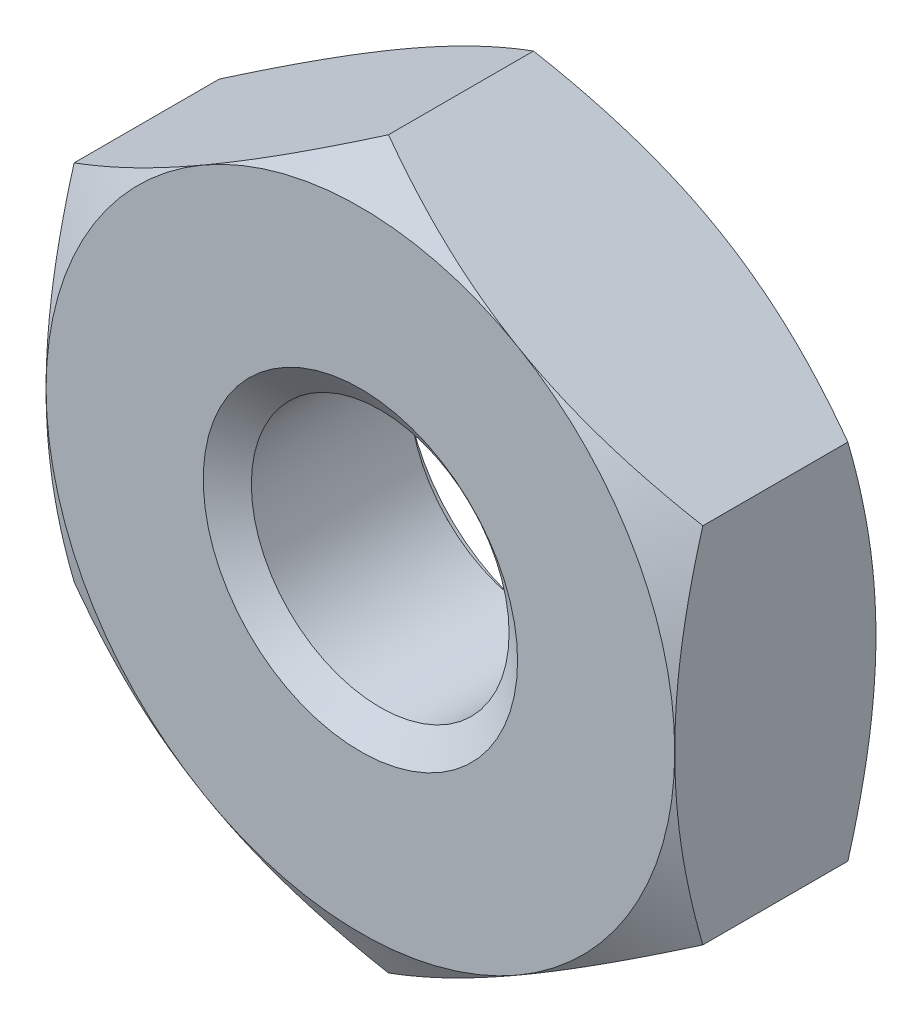
ISO-10303-21;
HEADER;
FILE_DESCRIPTION(('STEP AP214'),'2;1');
FILE_NAME('part.step','',(''),(''),'','','');
FILE_SCHEMA(('AUTOMOTIVE_DESIGN { 1 0 10303 214 1 1 1 1 }'));
ENDSEC;
DATA;
#1=APPLICATION_CONTEXT('core data for automotive mechanical design processes');
#2=APPLICATION_PROTOCOL_DEFINITION('international standard','automotive_design',2000,#1);
#3=PRODUCT_CONTEXT('',#1,'mechanical');
#4=PRODUCT('Part','Part','',(#3));
#5=PRODUCT_RELATED_PRODUCT_CATEGORY('part','',(#4));
#6=PRODUCT_DEFINITION_FORMATION('','',#4);
#7=PRODUCT_DEFINITION_CONTEXT('part definition',#1,'design');
#8=PRODUCT_DEFINITION('design','',#6,#7);
#9=PRODUCT_DEFINITION_SHAPE('','',#8);
#10=(LENGTH_UNIT() NAMED_UNIT(*) SI_UNIT(.MILLI.,.METRE.));
#11=(NAMED_UNIT(*) PLANE_ANGLE_UNIT() SI_UNIT($,.RADIAN.));
#12=(NAMED_UNIT(*) SI_UNIT($,.STERADIAN.) SOLID_ANGLE_UNIT());
#13=UNCERTAINTY_MEASURE_WITH_UNIT(LENGTH_MEASURE(1.E-05),#10,'distance_accuracy_value','');
#14=(GEOMETRIC_REPRESENTATION_CONTEXT(3) GLOBAL_UNCERTAINTY_ASSIGNED_CONTEXT((#13)) GLOBAL_UNIT_ASSIGNED_CONTEXT((#10,
#11,#12)) REPRESENTATION_CONTEXT('',''));
#15=CARTESIAN_POINT('',(0.,0.,0.));
#16=DIRECTION('',(0.,0.,1.));
#17=DIRECTION('',(1.,0.,0.));
#18=AXIS2_PLACEMENT_3D('',#15,#16,#17);
#19=CARTESIAN_POINT('',(0.,0.,-1.6));
#20=DIRECTION('',(0.,0.,1.));
#21=DIRECTION('',(1.,0.,0.));
#22=AXIS2_PLACEMENT_3D('',#19,#20,#21);
#23=CYLINDRICAL_SURFACE('',#22,1.025);
#24=CARTESIAN_POINT('',(0.,0.,-0.157546696097185));
#25=DIRECTION('',(0.,0.,1.));
#26=DIRECTION('',(1.,0.,0.));
#27=AXIS2_PLACEMENT_3D('',#24,#25,#26);
#28=CIRCLE('',#27,1.025);
#29=CARTESIAN_POINT('',(1.025,0.,-0.157546696097185));
#30=VERTEX_POINT('',#29);
#31=EDGE_CURVE('E176',#30,#30,#28,.F.);
#32=ORIENTED_EDGE('',*,*,#31,.F.);
#33=EDGE_LOOP('',(#32));
#34=FACE_BOUND('',#33,.T.);
#35=CARTESIAN_POINT('',(0.,0.,-1.41705330390281));
#36=DIRECTION('',(0.,0.,-1.));
#37=DIRECTION('',(-1.,0.,0.));
#38=AXIS2_PLACEMENT_3D('',#35,#36,#37);
#39=CIRCLE('',#38,1.025);
#40=CARTESIAN_POINT('',(-1.025,0.,-1.41705330390281));
#41=VERTEX_POINT('',#40);
#42=EDGE_CURVE('E41',#41,#41,#39,.F.);
#43=ORIENTED_EDGE('',*,*,#42,.F.);
#44=EDGE_LOOP('',(#43));
#45=FACE_BOUND('',#44,.T.);
#46=ADVANCED_FACE('F36',(#34,#45),#23,.F.);
#47=CARTESIAN_POINT('',(0.,2.88675134594813,-1.6));
#48=DIRECTION('',(0.,0.,-1.));
#49=DIRECTION('',(-1.,0.,0.));
#50=AXIS2_PLACEMENT_3D('',#47,#48,#49);
#51=PLANE('',#50);
#52=CARTESIAN_POINT('',(0.,0.,-1.6));
#53=DIRECTION('',(0.,0.,-1.));
#54=DIRECTION('',(-1.,0.,0.));
#55=AXIS2_PLACEMENT_3D('',#52,#53,#54);
#56=CIRCLE('',#55,2.5);
#57=CARTESIAN_POINT('',(-2.5,0.,-1.6));
#58=VERTEX_POINT('',#57);
#59=CARTESIAN_POINT('',(-1.25,-2.1650635094611,-1.6));
#60=VERTEX_POINT('',#59);
#61=EDGE_CURVE('E172',#58,#60,#56,.F.);
#62=ORIENTED_EDGE('',*,*,#61,.F.);
#63=CARTESIAN_POINT('',(-1.25,2.1650635094611,-1.6));
#64=VERTEX_POINT('',#63);
#65=EDGE_CURVE('E154',#64,#58,#56,.F.);
#66=ORIENTED_EDGE('',*,*,#65,.F.);
#67=CARTESIAN_POINT('',(1.25,2.1650635094611,-1.6));
#68=VERTEX_POINT('',#67);
#69=EDGE_CURVE('E171',#68,#64,#56,.F.);
#70=ORIENTED_EDGE('',*,*,#69,.F.);
#71=CARTESIAN_POINT('',(0.,0.,-1.6));
#72=DIRECTION('',(0.,0.,1.));
#73=DIRECTION('',(1.,0.,0.));
#74=AXIS2_PLACEMENT_3D('',#71,#72,#73);
#75=CIRCLE('',#74,2.5);
#76=CARTESIAN_POINT('',(2.5,0.,-1.6));
#77=VERTEX_POINT('',#76);
#78=EDGE_CURVE('E246',#77,#68,#75,.T.);
#79=ORIENTED_EDGE('',*,*,#78,.F.);
#80=CARTESIAN_POINT('',(1.25,-2.1650635094611,-1.6));
#81=VERTEX_POINT('',#80);
#82=EDGE_CURVE('E362',#81,#77,#56,.F.);
#83=ORIENTED_EDGE('',*,*,#82,.F.);
#84=EDGE_CURVE('E366',#60,#81,#56,.F.);
#85=ORIENTED_EDGE('',*,*,#84,.F.);
#86=EDGE_LOOP('',(#62,#66,#70,#79,#83,#85));
#87=FACE_BOUND('',#86,.T.);
#88=CARTESIAN_POINT('',(0.,0.,-1.6));
#89=DIRECTION('',(0.,0.,-1.));
#90=DIRECTION('',(-1.,0.,0.));
#91=AXIS2_PLACEMENT_3D('',#88,#89,#90);
#92=CIRCLE('',#91,1.25);
#93=CARTESIAN_POINT('',(-1.25,0.,-1.6));
#94=VERTEX_POINT('',#93);
#95=EDGE_CURVE('E179',#94,#94,#92,.F.);
#96=ORIENTED_EDGE('',*,*,#95,.T.);
#97=EDGE_LOOP('',(#96));
#98=FACE_BOUND('',#97,.T.);
#99=ADVANCED_FACE('F299',(#87,#98),#51,.T.);
#100=CARTESIAN_POINT('',(0.,2.88675134594813,0.));
#101=DIRECTION('',(0.,0.,-1.));
#102=DIRECTION('',(-1.,0.,0.));
#103=AXIS2_PLACEMENT_3D('',#100,#101,#102);
#104=PLANE('',#103);
#105=CARTESIAN_POINT('',(0.,0.,0.));
#106=DIRECTION('',(0.,0.,-1.));
#107=DIRECTION('',(-1.,0.,0.));
#108=AXIS2_PLACEMENT_3D('',#105,#106,#107);
#109=CIRCLE('',#108,2.5);
#110=CARTESIAN_POINT('',(-2.5,0.,0.));
#111=VERTEX_POINT('',#110);
#112=CARTESIAN_POINT('',(-1.25,2.1650635094611,0.));
#113=VERTEX_POINT('',#112);
#114=EDGE_CURVE('E11',#111,#113,#109,.T.);
#115=ORIENTED_EDGE('',*,*,#114,.F.);
#116=CARTESIAN_POINT('',(-1.25,-2.1650635094611,0.));
#117=VERTEX_POINT('',#116);
#118=EDGE_CURVE('E48',#117,#111,#109,.T.);
#119=ORIENTED_EDGE('',*,*,#118,.F.);
#120=CARTESIAN_POINT('',(1.25,-2.1650635094611,0.));
#121=VERTEX_POINT('',#120);
#122=EDGE_CURVE('E175',#121,#117,#109,.T.);
#123=ORIENTED_EDGE('',*,*,#122,.F.);
#124=CARTESIAN_POINT('',(2.5,0.,0.));
#125=VERTEX_POINT('',#124);
#126=EDGE_CURVE('E353',#125,#121,#109,.T.);
#127=ORIENTED_EDGE('',*,*,#126,.F.);
#128=CARTESIAN_POINT('',(0.,0.,0.));
#129=DIRECTION('',(0.,0.,1.));
#130=DIRECTION('',(1.,0.,0.));
#131=AXIS2_PLACEMENT_3D('',#128,#129,#130);
#132=CIRCLE('',#131,2.5);
#133=CARTESIAN_POINT('',(1.25,2.1650635094611,0.));
#134=VERTEX_POINT('',#133);
#135=EDGE_CURVE('E130',#125,#134,#132,.T.);
#136=ORIENTED_EDGE('',*,*,#135,.T.);
#137=EDGE_CURVE('E46',#113,#134,#109,.T.);
#138=ORIENTED_EDGE('',*,*,#137,.F.);
#139=EDGE_LOOP('',(#115,#119,#123,#127,#136,#138));
#140=FACE_BOUND('',#139,.T.);
#141=CARTESIAN_POINT('',(0.,0.,0.));
#142=DIRECTION('',(0.,0.,1.));
#143=DIRECTION('',(1.,0.,0.));
#144=AXIS2_PLACEMENT_3D('',#141,#142,#143);
#145=CIRCLE('',#144,1.25);
#146=CARTESIAN_POINT('',(1.25,0.,0.));
#147=VERTEX_POINT('',#146);
#148=EDGE_CURVE('E178',#147,#147,#145,.T.);
#149=ORIENTED_EDGE('',*,*,#148,.F.);
#150=EDGE_LOOP('',(#149));
#151=FACE_BOUND('',#150,.T.);
#152=ADVANCED_FACE('F251',(#140,#151),#104,.F.);
#153=CARTESIAN_POINT('',(0.,2.88675134594813,-1.6));
#154=DIRECTION('',(-0.500000000000001,0.866025403784438,0.));
#155=DIRECTION('',(-0.866025403784438,-0.500000000000001,0.));
#156=AXIS2_PLACEMENT_3D('',#153,#154,#155);
#157=PLANE('',#156);
#158=DIRECTION('',(0.,0.,1.));
#159=VECTOR('',#158,1.);
#160=CARTESIAN_POINT('',(-2.5,1.44337567297406,-1.6));
#161=LINE('',#160,#159);
#162=CARTESIAN_POINT('',(-2.5,1.44337567297407,-1.3767090063074));
#163=VERTEX_POINT('',#162);
#164=CARTESIAN_POINT('',(-2.5,1.44337567297406,-0.223290993692602));
#165=VERTEX_POINT('',#164);
#166=EDGE_CURVE('E166',#163,#165,#161,.T.);
#167=ORIENTED_EDGE('',*,*,#166,.T.);
#168=CARTESIAN_POINT('',(-2.5002,1.44326020292023,-0.223357664359109));
#169=CARTESIAN_POINT('',(-2.39033676526513,1.50668977106845,-0.186721620107626));
#170=CARTESIAN_POINT('',(-2.27952520010347,1.57066685804385,-0.153402218965056));
#171=CARTESIAN_POINT('',(-2.05598316653395,1.69972891130041,-0.095242285557858));
#172=CARTESIAN_POINT('',(-1.94324872547161,1.7648161711947,-0.0704223291477385));
#173=CARTESIAN_POINT('',(-1.71917700612473,1.8941840386774,-0.0317856514410522));
#174=CARTESIAN_POINT('',(-1.60787420823262,1.95844473900197,-0.0177117961856392));
#175=CARTESIAN_POINT('',(-1.38474477253167,2.08726857876804,-0.0009091523527504));
#176=CARTESIAN_POINT('',(-1.27291894598577,2.15183124982667,0.00183354879637324));
#177=CARTESIAN_POINT('',(-1.06395802444848,2.27247489412634,-0.00386576000805384));
#178=CARTESIAN_POINT('',(-0.966791682442269,2.32857390783979,-0.0109083943818622));
#179=CARTESIAN_POINT('',(-0.773092050288997,2.44040644260542,-0.0332314191249434));
#180=CARTESIAN_POINT('',(-0.676559430340267,2.4961395767184,-0.0485194384402682));
#181=CARTESIAN_POINT('',(-0.482460278259523,2.60820277442169,-0.0867390938444218));
#182=CARTESIAN_POINT('',(-0.384918318217859,2.66451865130903,-0.109832776125519));
#183=CARTESIAN_POINT('',(-0.191289391923914,2.77631036402774,-0.162246656577915));
#184=CARTESIAN_POINT('',(-0.0951999441138233,2.83178763258718,-0.191554535624551));
#185=CARTESIAN_POINT('',(0.000200000000000702,2.88686681600197,-0.223357664359111));
#186=B_SPLINE_CURVE_WITH_KNOTS('',3,(#168,#169,#170,#171,#172,#173,#174,#175,#176,#177,#178,
#179,#180,#181,#182,#183,#184,#185),.UNSPECIFIED.,.F.,.F.,(4,2,2,2,2,2,2,2,4),(0.,
0.396285827362227,0.793524330152052,1.18093086852114,1.56786160134475,1.90479741793733,
2.24204551660463,2.58677531536756,2.93082800105257),.UNSPECIFIED.);
#187=EDGE_CURVE('E135',#165,#113,#186,.T.);
#188=ORIENTED_EDGE('',*,*,#187,.T.);
#189=CARTESIAN_POINT('',(0.,2.88675134594813,-0.223290993692604));
#190=VERTEX_POINT('',#189);
#191=EDGE_CURVE('E55',#113,#190,#186,.T.);
#192=ORIENTED_EDGE('',*,*,#191,.T.);
#193=DIRECTION('',(0.,0.,1.));
#194=VECTOR('',#193,1.);
#195=CARTESIAN_POINT('',(0.,2.88675134594813,-1.6));
#196=LINE('',#195,#194);
#197=CARTESIAN_POINT('',(0.,2.88675134594813,-1.3767090063074));
#198=VERTEX_POINT('',#197);
#199=EDGE_CURVE('E151',#198,#190,#196,.T.);
#200=ORIENTED_EDGE('',*,*,#199,.F.);
#201=CARTESIAN_POINT('',(-2.5002,1.44326020292023,-1.37664233564089));
#202=CARTESIAN_POINT('',(-2.39033676526513,1.50668977106845,-1.41327837989237));
#203=CARTESIAN_POINT('',(-2.27952520010347,1.57066685804385,-1.44659778103494));
#204=CARTESIAN_POINT('',(-2.05598316653395,1.69972891130041,-1.50475771444214));
#205=CARTESIAN_POINT('',(-1.94324872547161,1.7648161711947,-1.52957767085226));
#206=CARTESIAN_POINT('',(-1.71917700612473,1.8941840386774,-1.56821434855895));
#207=CARTESIAN_POINT('',(-1.60787420823262,1.95844473900197,-1.58228820381436));
#208=CARTESIAN_POINT('',(-1.38474477253167,2.08726857876804,-1.59909084764725));
#209=CARTESIAN_POINT('',(-1.27291894598577,2.15183124982667,-1.60183354879637));
#210=CARTESIAN_POINT('',(-1.06395802444848,2.27247489412634,-1.59613423999195));
#211=CARTESIAN_POINT('',(-0.966791682442269,2.32857390783979,-1.58909160561814));
#212=CARTESIAN_POINT('',(-0.773092050288997,2.44040644260542,-1.56676858087506));
#213=CARTESIAN_POINT('',(-0.676559430340267,2.4961395767184,-1.55148056155973));
#214=CARTESIAN_POINT('',(-0.482460278259523,2.60820277442169,-1.51326090615558));
#215=CARTESIAN_POINT('',(-0.384918318217859,2.66451865130903,-1.49016722387448));
#216=CARTESIAN_POINT('',(-0.191289391923914,2.77631036402774,-1.43775334342208));
#217=CARTESIAN_POINT('',(-0.0951999441138231,2.83178763258718,-1.40844546437545));
#218=CARTESIAN_POINT('',(0.000200000000000703,2.88686681600197,-1.37664233564089));
#219=B_SPLINE_CURVE_WITH_KNOTS('',3,(#201,#202,#203,#204,#205,#206,#207,#208,#209,#210,#211,
#212,#213,#214,#215,#216,#217,#218),.UNSPECIFIED.,.F.,.F.,(4,2,2,2,2,2,2,2,4),(0.,
0.396285827362227,0.793524330152051,1.18093086852114,1.56786160134475,1.90479741793733,
2.24204551660463,2.58677531536756,2.93082800105257),.UNSPECIFIED.);
#220=EDGE_CURVE('E169',#64,#198,#219,.T.);
#221=ORIENTED_EDGE('',*,*,#220,.F.);
#222=EDGE_CURVE('E261',#163,#64,#219,.T.);
#223=ORIENTED_EDGE('',*,*,#222,.F.);
#224=EDGE_LOOP('',(#167,#188,#192,#200,#221,#223));
#225=FACE_BOUND('',#224,.T.);
#226=ADVANCED_FACE('F38',(#225),#157,.T.);
#227=CARTESIAN_POINT('',(2.5,1.44337567297406,-1.6));
#228=DIRECTION('',(0.500000000000001,0.866025403784438,0.));
#229=DIRECTION('',(-0.866025403784438,0.500000000000001,0.));
#230=AXIS2_PLACEMENT_3D('',#227,#228,#229);
#231=PLANE('',#230);
#232=ORIENTED_EDGE('',*,*,#199,.T.);
#233=CARTESIAN_POINT('',(-0.000199999999999425,2.88686681600197,-0.223357664359111));
#234=CARTESIAN_POINT('',(0.109663234734872,2.82343724785375,-0.186721620107628));
#235=CARTESIAN_POINT('',(0.220474799896526,2.75946016087834,-0.153402218965058));
#236=CARTESIAN_POINT('',(0.44401683346605,2.63039810762178,-0.095242285557859));
#237=CARTESIAN_POINT('',(0.556751274528389,2.5653108477275,-0.0704223291477394));
#238=CARTESIAN_POINT('',(0.780822993875269,2.43594298024479,-0.0317856514410528));
#239=CARTESIAN_POINT('',(0.892125791767378,2.37168227992023,-0.0177117961856394));
#240=CARTESIAN_POINT('',(1.11525522746833,2.24285844015415,-0.000909152352750264));
#241=CARTESIAN_POINT('',(1.22708105401423,2.17829576909552,0.00183354879637354));
#242=CARTESIAN_POINT('',(1.43604197555152,2.05765212479586,-0.00386576000805328));
#243=CARTESIAN_POINT('',(1.53320831755773,2.0015531110824,-0.0109083943818615));
#244=CARTESIAN_POINT('',(1.726907949711,1.88972057631678,-0.0332314191249424));
#245=CARTESIAN_POINT('',(1.82344056965973,1.8339874422038,-0.048519438440267));
#246=CARTESIAN_POINT('',(2.01753972174048,1.7219242445005,-0.0867390938444202));
#247=CARTESIAN_POINT('',(2.11508168178214,1.66560836761316,-0.109832776125517));
#248=CARTESIAN_POINT('',(2.30871060807608,1.55381665489445,-0.162246656577913));
#249=CARTESIAN_POINT('',(2.40480005588618,1.49833938633502,-0.191554535624548));
#250=CARTESIAN_POINT('',(2.5002,1.44326020292022,-0.223357664359108));
#251=B_SPLINE_CURVE_WITH_KNOTS('',3,(#233,#234,#235,#236,#237,#238,#239,#240,#241,#242,#243,
#244,#245,#246,#247,#248,#249,#250),.UNSPECIFIED.,.F.,.F.,(4,2,2,2,2,2,2,2,4),(0.,
0.396285827362227,0.793524330152052,1.18093086852114,1.56786160134476,1.90479741793733,
2.24204551660463,2.58677531536756,2.93082800105257),.UNSPECIFIED.);
#252=EDGE_CURVE('E145',#190,#134,#251,.T.);
#253=ORIENTED_EDGE('',*,*,#252,.T.);
#254=CARTESIAN_POINT('',(2.5,1.44337567297407,-0.223290993692604));
#255=VERTEX_POINT('',#254);
#256=EDGE_CURVE('E62',#134,#255,#251,.T.);
#257=ORIENTED_EDGE('',*,*,#256,.T.);
#258=DIRECTION('',(0.,0.,1.));
#259=VECTOR('',#258,1.);
#260=CARTESIAN_POINT('',(2.5,1.44337567297406,-1.6));
#261=LINE('',#260,#259);
#262=CARTESIAN_POINT('',(2.5,1.44337567297407,-1.3767090063074));
#263=VERTEX_POINT('',#262);
#264=EDGE_CURVE('E144',#263,#255,#261,.T.);
#265=ORIENTED_EDGE('',*,*,#264,.F.);
#266=CARTESIAN_POINT('',(-0.000199999999999439,2.88686681600197,-1.37664233564089));
#267=CARTESIAN_POINT('',(0.109663234734872,2.82343724785375,-1.41327837989237));
#268=CARTESIAN_POINT('',(0.220474799896526,2.75946016087834,-1.44659778103494));
#269=CARTESIAN_POINT('',(0.44401683346605,2.63039810762178,-1.50475771444214));
#270=CARTESIAN_POINT('',(0.556751274528389,2.5653108477275,-1.52957767085226));
#271=CARTESIAN_POINT('',(0.78082299387527,2.43594298024479,-1.56821434855895));
#272=CARTESIAN_POINT('',(0.892125791767378,2.37168227992023,-1.58228820381436));
#273=CARTESIAN_POINT('',(1.11525522746833,2.24285844015415,-1.59909084764725));
#274=CARTESIAN_POINT('',(1.22708105401423,2.17829576909552,-1.60183354879637));
#275=CARTESIAN_POINT('',(1.43604197555152,2.05765212479586,-1.59613423999195));
#276=CARTESIAN_POINT('',(1.53320831755773,2.0015531110824,-1.58909160561814));
#277=CARTESIAN_POINT('',(1.726907949711,1.88972057631678,-1.56676858087506));
#278=CARTESIAN_POINT('',(1.82344056965973,1.8339874422038,-1.55148056155973));
#279=CARTESIAN_POINT('',(2.01753972174048,1.7219242445005,-1.51326090615558));
#280=CARTESIAN_POINT('',(2.11508168178214,1.66560836761316,-1.49016722387448));
#281=CARTESIAN_POINT('',(2.30871060807608,1.55381665489445,-1.43775334342209));
#282=CARTESIAN_POINT('',(2.40480005588618,1.49833938633502,-1.40844546437545));
#283=CARTESIAN_POINT('',(2.5002,1.44326020292022,-1.37664233564089));
#284=B_SPLINE_CURVE_WITH_KNOTS('',3,(#266,#267,#268,#269,#270,#271,#272,#273,#274,#275,#276,
#277,#278,#279,#280,#281,#282,#283),.UNSPECIFIED.,.F.,.F.,(4,2,2,2,2,2,2,2,4),(0.,
0.396285827362227,0.793524330152052,1.18093086852114,1.56786160134476,1.90479741793733,
2.24204551660463,2.58677531536756,2.93082800105257),.UNSPECIFIED.);
#285=EDGE_CURVE('E255',#68,#263,#284,.T.);
#286=ORIENTED_EDGE('',*,*,#285,.F.);
#287=EDGE_CURVE('E260',#198,#68,#284,.T.);
#288=ORIENTED_EDGE('',*,*,#287,.F.);
#289=EDGE_LOOP('',(#232,#253,#257,#265,#286,#288));
#290=FACE_BOUND('',#289,.T.);
#291=ADVANCED_FACE('F142',(#290),#231,.T.);
#292=CARTESIAN_POINT('',(2.5,1.44337567297406,-1.6));
#293=DIRECTION('',(-1.,0.,0.));
#294=DIRECTION('',(0.,0.,1.));
#295=AXIS2_PLACEMENT_3D('',#292,#293,#294);
#296=PLANE('',#295);
#297=CARTESIAN_POINT('',(2.5,-3.82804499372433,-1.1963167632754));
#298=CARTESIAN_POINT('',(2.5,-3.71828085649173,-1.14327266922931));
#299=CARTESIAN_POINT('',(2.5,-3.60825720059554,-1.09075587737962));
#300=CARTESIAN_POINT('',(2.5,-3.38755052986222,-0.987078216748228));
#301=CARTESIAN_POINT('',(2.5,-3.27686740487455,-0.93591758272952));
#302=CARTESIAN_POINT('',(2.5,-3.05410357303959,-0.834984039411598));
#303=CARTESIAN_POINT('',(2.5,-2.94201849305851,-0.785220746914399));
#304=CARTESIAN_POINT('',(2.5,-2.7169270921704,-0.687831615887686));
#305=CARTESIAN_POINT('',(2.5,-2.60392081964711,-0.640205665942513));
#306=CARTESIAN_POINT('',(2.5,-2.37540441715611,-0.547094156496476));
#307=CARTESIAN_POINT('',(2.5,-2.25988058014231,-0.501642052634903));
#308=CARTESIAN_POINT('',(2.5,-2.02747029246855,-0.414297644349638));
#309=CARTESIAN_POINT('',(2.5,-1.91058369184876,-0.372405735979065));
#310=CARTESIAN_POINT('',(2.5,-1.67550198908607,-0.293307342769301));
#311=CARTESIAN_POINT('',(2.5,-1.5573102732053,-0.256090896739899));
#312=CARTESIAN_POINT('',(2.5,-1.31924659147407,-0.187552097840317));
#313=CARTESIAN_POINT('',(2.5,-1.19937516991093,-0.15622788104797));
#314=CARTESIAN_POINT('',(2.5,-0.95787020436375,-0.100994246846276));
#315=CARTESIAN_POINT('',(2.5,-0.836236200197811,-0.0770868037228379));
#316=CARTESIAN_POINT('',(2.5,-0.591501703670347,-0.0382963974514649));
#317=CARTESIAN_POINT('',(2.5,-0.468401210012359,-0.023413442282312));
#318=CARTESIAN_POINT('',(2.5,-0.222157493517465,-0.00398863321839778));
#319=CARTESIAN_POINT('',(2.5,-0.0990195694337581,0.000618687975650648));
#320=CARTESIAN_POINT('',(2.5,0.147170053504667,-0.000752541484247536));
#321=CARTESIAN_POINT('',(2.5,0.270221766445127,-0.00672834425959447));
#322=CARTESIAN_POINT('',(2.5,0.480350397015947,-0.0255492091334944));
#323=CARTESIAN_POINT('',(2.5,0.567659136488636,-0.0359433100274437));
#324=CARTESIAN_POINT('',(2.5,0.741602181646857,-0.0613833814666825));
#325=CARTESIAN_POINT('',(2.5,0.828236378756331,-0.0764300856615292));
#326=CARTESIAN_POINT('',(2.5,1.08705653408106,-0.127759419343895));
#327=CARTESIAN_POINT('',(2.5,1.25802931580451,-0.170218054015721));
#328=CARTESIAN_POINT('',(2.5,1.51386408134077,-0.243447724573253));
#329=CARTESIAN_POINT('',(2.5,1.60005960225962,-0.269821213632273));
#330=CARTESIAN_POINT('',(2.5,1.77155099438377,-0.325177862642352));
#331=CARTESIAN_POINT('',(2.5,1.85684744139723,-0.354159222616821));
#332=CARTESIAN_POINT('',(2.5,2.02618400322713,-0.41412856198768));
#333=CARTESIAN_POINT('',(2.5,2.11022848716774,-0.445104328595938));
#334=CARTESIAN_POINT('',(2.5,2.27766538220571,-0.50887397111919));
#335=CARTESIAN_POINT('',(2.5,2.36105751399617,-0.541668581852107));
#336=CARTESIAN_POINT('',(2.5,2.44414811866678,-0.575193129088622));
#337=B_SPLINE_CURVE_WITH_KNOTS('',3,(#297,#298,#299,#300,#301,#302,#303,#304,#305,#306,#307,
#308,#309,#310,#311,#312,#313,#314,#315,#316,#317,#318,#319,#320,#321,#322,#323,#324,#325,#326,
#327,#328,#329,#330,#331,#332,#333,#334,#335,#336),.UNSPECIFIED.,.F.,.F.,(4,2,2,2,2,2,2,2,2,2,2,
2,2,2,2,2,2,2,2,4),(0.,0.36573237033267,0.731527644124544,1.09941621653744,1.46728558928017,
1.83967125623427,2.21209829506681,2.58371790436,2.9552197586967,3.32682041917403,
3.69842140819258,4.06764803658773,4.43677881037429,4.70042588015951,4.96411454456775,
5.49188432099894,5.76228301186056,6.03249648197686,6.30118900914357,6.56999089095293),.UNSPECIFIED.);
#338=CARTESIAN_POINT('',(2.5,-1.44337567297407,-0.223290993692604));
#339=VERTEX_POINT('',#338);
#340=EDGE_CURVE('E137',#339,#125,#337,.T.);
#341=ORIENTED_EDGE('',*,*,#340,.F.);
#342=DIRECTION('',(0.,0.,1.));
#343=VECTOR('',#342,1.);
#344=CARTESIAN_POINT('',(2.5,-1.44337567297407,-1.6));
#345=LINE('',#344,#343);
#346=CARTESIAN_POINT('',(2.5,-1.44337567297407,-1.3767090063074));
#347=VERTEX_POINT('',#346);
#348=EDGE_CURVE('E152',#347,#339,#345,.T.);
#349=ORIENTED_EDGE('',*,*,#348,.F.);
#350=CARTESIAN_POINT('',(2.5,-3.82804499372433,-0.4036832367246));
#351=CARTESIAN_POINT('',(2.5,-3.71828085649173,-0.456727330770688));
#352=CARTESIAN_POINT('',(2.5,-3.60825720059554,-0.509244122620376));
#353=CARTESIAN_POINT('',(2.5,-3.38755052986222,-0.612921783251772));
#354=CARTESIAN_POINT('',(2.5,-3.27686740487455,-0.66408241727048));
#355=CARTESIAN_POINT('',(2.5,-3.05410357303959,-0.765015960588401));
#356=CARTESIAN_POINT('',(2.5,-2.94201849305851,-0.814779253085601));
#357=CARTESIAN_POINT('',(2.5,-2.7169270921704,-0.912168384112314));
#358=CARTESIAN_POINT('',(2.5,-2.60392081964711,-0.959794334057487));
#359=CARTESIAN_POINT('',(2.5,-2.37540441715611,-1.05290584350352));
#360=CARTESIAN_POINT('',(2.5,-2.25988058014231,-1.0983579473651));
#361=CARTESIAN_POINT('',(2.5,-2.02747029246855,-1.18570235565036));
#362=CARTESIAN_POINT('',(2.5,-1.91058369184876,-1.22759426402093));
#363=CARTESIAN_POINT('',(2.5,-1.67550198908607,-1.3066926572307));
#364=CARTESIAN_POINT('',(2.5,-1.5573102732053,-1.3439091032601));
#365=CARTESIAN_POINT('',(2.5,-1.31924659147407,-1.41244790215968));
#366=CARTESIAN_POINT('',(2.5,-1.19937516991093,-1.44377211895203));
#367=CARTESIAN_POINT('',(2.5,-0.95787020436375,-1.49900575315372));
#368=CARTESIAN_POINT('',(2.5,-0.836236200197811,-1.52291319627716));
#369=CARTESIAN_POINT('',(2.5,-0.591501703670347,-1.56170360254854));
#370=CARTESIAN_POINT('',(2.5,-0.46840121001236,-1.57658655771769));
#371=CARTESIAN_POINT('',(2.5,-0.222157493517465,-1.5960113667816));
#372=CARTESIAN_POINT('',(2.5,-0.0990195694337581,-1.60061868797565));
#373=CARTESIAN_POINT('',(2.5,0.147170053504667,-1.59924745851575));
#374=CARTESIAN_POINT('',(2.5,0.270221766445127,-1.59327165574041));
#375=CARTESIAN_POINT('',(2.5,0.480350397015947,-1.57445079086651));
#376=CARTESIAN_POINT('',(2.5,0.567659136488636,-1.56405668997256));
#377=CARTESIAN_POINT('',(2.5,0.741602181646856,-1.53861661853332));
#378=CARTESIAN_POINT('',(2.5,0.828236378756331,-1.52356991433847));
#379=CARTESIAN_POINT('',(2.5,1.08705653408106,-1.47224058065611));
#380=CARTESIAN_POINT('',(2.5,1.25802931580451,-1.42978194598428));
#381=CARTESIAN_POINT('',(2.5,1.51386408134077,-1.35655227542675));
#382=CARTESIAN_POINT('',(2.5,1.60005960225962,-1.33017878636773));
#383=CARTESIAN_POINT('',(2.5,1.77155099438377,-1.27482213735765));
#384=CARTESIAN_POINT('',(2.5,1.85684744139723,-1.24584077738318));
#385=CARTESIAN_POINT('',(2.5,2.02618400322713,-1.18587143801232));
#386=CARTESIAN_POINT('',(2.5,2.11022848716774,-1.15489567140406));
#387=CARTESIAN_POINT('',(2.5,2.27766538220571,-1.09112602888081));
#388=CARTESIAN_POINT('',(2.5,2.36105751399617,-1.05833141814789));
#389=CARTESIAN_POINT('',(2.5,2.44414811866678,-1.02480687091138));
#390=B_SPLINE_CURVE_WITH_KNOTS('',3,(#350,#351,#352,#353,#354,#355,#356,#357,#358,#359,#360,
#361,#362,#363,#364,#365,#366,#367,#368,#369,#370,#371,#372,#373,#374,#375,#376,#377,#378,#379,
#380,#381,#382,#383,#384,#385,#386,#387,#388,#389),.UNSPECIFIED.,.F.,.F.,(4,2,2,2,2,2,2,2,2,2,2,
2,2,2,2,2,2,2,2,4),(0.,0.36573237033267,0.731527644124544,1.09941621653744,1.46728558928017,
1.83967125623427,2.21209829506681,2.58371790436,2.9552197586967,3.32682041917403,
3.69842140819258,4.06764803658773,4.43677881037429,4.70042588015951,4.96411454456775,
5.49188432099894,5.76228301186056,6.03249648197686,6.30118900914357,6.56999089095294),.UNSPECIFIED.);
#391=EDGE_CURVE('E267',#347,#77,#390,.T.);
#392=ORIENTED_EDGE('',*,*,#391,.T.);
#393=EDGE_CURVE('E150',#77,#263,#390,.T.);
#394=ORIENTED_EDGE('',*,*,#393,.T.);
#395=ORIENTED_EDGE('',*,*,#264,.T.);
#396=EDGE_CURVE('E127',#125,#255,#337,.T.);
#397=ORIENTED_EDGE('',*,*,#396,.F.);
#398=EDGE_LOOP('',(#341,#349,#392,#394,#395,#397));
#399=FACE_BOUND('',#398,.T.);
#400=ADVANCED_FACE('F148',(#399),#296,.F.);
#401=CARTESIAN_POINT('',(0.,-2.88675134594814,-1.6));
#402=DIRECTION('',(0.500000000000001,-0.866025403784438,0.));
#403=DIRECTION('',(0.866025403784438,0.500000000000001,0.));
#404=AXIS2_PLACEMENT_3D('',#401,#402,#403);
#405=PLANE('',#404);
#406=ORIENTED_EDGE('',*,*,#348,.T.);
#407=CARTESIAN_POINT('',(2.5002,-1.44326020292023,-0.223357664359111));
#408=CARTESIAN_POINT('',(2.39033676526513,-1.50668977106845,-0.186721620107628));
#409=CARTESIAN_POINT('',(2.27952520010347,-1.57066685804386,-0.153402218965058));
#410=CARTESIAN_POINT('',(2.05598316653395,-1.69972891130042,-0.0952422855578599));
#411=CARTESIAN_POINT('',(1.94324872547161,-1.7648161711947,-0.0704223291477404));
#412=CARTESIAN_POINT('',(1.71917700612473,-1.89418403867741,-0.0317856514410543));
#413=CARTESIAN_POINT('',(1.60787420823262,-1.95844473900197,-0.0177117961856414));
#414=CARTESIAN_POINT('',(1.38474477253167,-2.08726857876805,-0.00090915235275299));
#415=CARTESIAN_POINT('',(1.27291894598577,-2.15183124982667,0.00183354879637055));
#416=CARTESIAN_POINT('',(1.06395802444848,-2.27247489412634,-0.00386576000805677));
#417=CARTESIAN_POINT('',(0.966791682442268,-2.3285739078398,-0.0109083943818652));
#418=CARTESIAN_POINT('',(0.773092050288996,-2.44040644260542,-0.0332314191249465));
#419=CARTESIAN_POINT('',(0.676559430340267,-2.4961395767184,-0.0485194384402712));
#420=CARTESIAN_POINT('',(0.482460278259523,-2.6082027744217,-0.0867390938444247));
#421=CARTESIAN_POINT('',(0.384918318217859,-2.66451865130904,-0.109832776125522));
#422=CARTESIAN_POINT('',(0.191289391923914,-2.77631036402774,-0.162246656577918));
#423=CARTESIAN_POINT('',(0.0951999441138231,-2.83178763258718,-0.191554535624554));
#424=CARTESIAN_POINT('',(-0.0002000000000006,-2.88686681600197,-0.223357664359114));
#425=B_SPLINE_CURVE_WITH_KNOTS('',3,(#407,#408,#409,#410,#411,#412,#413,#414,#415,#416,#417,
#418,#419,#420,#421,#422,#423,#424),.UNSPECIFIED.,.F.,.F.,(4,2,2,2,2,2,2,2,4),(0.,
0.396285827362227,0.793524330152052,1.18093086852114,1.56786160134476,1.90479741793733,
2.24204551660463,2.58677531536756,2.93082800105257),.UNSPECIFIED.);
#426=EDGE_CURVE('E348',#339,#121,#425,.T.);
#427=ORIENTED_EDGE('',*,*,#426,.T.);
#428=CARTESIAN_POINT('',(0.,-2.88675134594813,-0.223290993692604));
#429=VERTEX_POINT('',#428);
#430=EDGE_CURVE('E227',#121,#429,#425,.T.);
#431=ORIENTED_EDGE('',*,*,#430,.T.);
#432=DIRECTION('',(0.,0.,1.));
#433=VECTOR('',#432,1.);
#434=CARTESIAN_POINT('',(0.,-2.88675134594814,-1.6));
#435=LINE('',#434,#433);
#436=CARTESIAN_POINT('',(0.,-2.88675134594813,-1.3767090063074));
#437=VERTEX_POINT('',#436);
#438=EDGE_CURVE('E157',#437,#429,#435,.T.);
#439=ORIENTED_EDGE('',*,*,#438,.F.);
#440=CARTESIAN_POINT('',(2.5002,-1.44326020292023,-1.37664233564089));
#441=CARTESIAN_POINT('',(2.39033676526513,-1.50668977106845,-1.41327837989237));
#442=CARTESIAN_POINT('',(2.27952520010347,-1.57066685804386,-1.44659778103494));
#443=CARTESIAN_POINT('',(2.05598316653395,-1.69972891130042,-1.50475771444214));
#444=CARTESIAN_POINT('',(1.94324872547161,-1.7648161711947,-1.52957767085226));
#445=CARTESIAN_POINT('',(1.71917700612473,-1.89418403867741,-1.56821434855895));
#446=CARTESIAN_POINT('',(1.60787420823262,-1.95844473900197,-1.58228820381436));
#447=CARTESIAN_POINT('',(1.38474477253167,-2.08726857876805,-1.59909084764725));
#448=CARTESIAN_POINT('',(1.27291894598577,-2.15183124982667,-1.60183354879637));
#449=CARTESIAN_POINT('',(1.06395802444848,-2.27247489412634,-1.59613423999194));
#450=CARTESIAN_POINT('',(0.966791682442268,-2.3285739078398,-1.58909160561813));
#451=CARTESIAN_POINT('',(0.773092050288996,-2.44040644260542,-1.56676858087505));
#452=CARTESIAN_POINT('',(0.676559430340267,-2.4961395767184,-1.55148056155973));
#453=CARTESIAN_POINT('',(0.482460278259523,-2.6082027744217,-1.51326090615558));
#454=CARTESIAN_POINT('',(0.384918318217859,-2.66451865130904,-1.49016722387448));
#455=CARTESIAN_POINT('',(0.191289391923914,-2.77631036402774,-1.43775334342208));
#456=CARTESIAN_POINT('',(0.0951999441138234,-2.83178763258718,-1.40844546437545));
#457=CARTESIAN_POINT('',(-0.000200000000000601,-2.88686681600197,-1.37664233564089));
#458=B_SPLINE_CURVE_WITH_KNOTS('',3,(#440,#441,#442,#443,#444,#445,#446,#447,#448,#449,#450,
#451,#452,#453,#454,#455,#456,#457),.UNSPECIFIED.,.F.,.F.,(4,2,2,2,2,2,2,2,4),(0.,
0.396285827362227,0.793524330152052,1.18093086852114,1.56786160134476,1.90479741793733,
2.24204551660463,2.58677531536756,2.93082800105257),.UNSPECIFIED.);
#459=EDGE_CURVE('E273',#81,#437,#458,.T.);
#460=ORIENTED_EDGE('',*,*,#459,.F.);
#461=EDGE_CURVE('E272',#347,#81,#458,.T.);
#462=ORIENTED_EDGE('',*,*,#461,.F.);
#463=EDGE_LOOP('',(#406,#427,#431,#439,#460,#462));
#464=FACE_BOUND('',#463,.T.);
#465=ADVANCED_FACE('F283',(#464),#405,.T.);
#466=CARTESIAN_POINT('',(-2.5,-1.44337567297407,-1.6));
#467=DIRECTION('',(-0.500000000000001,-0.866025403784438,0.));
#468=DIRECTION('',(0.866025403784438,-0.500000000000001,0.));
#469=AXIS2_PLACEMENT_3D('',#466,#467,#468);
#470=PLANE('',#469);
#471=ORIENTED_EDGE('',*,*,#438,.T.);
#472=CARTESIAN_POINT('',(0.000199999999999562,-2.88686681600197,-0.223357664359113));
#473=CARTESIAN_POINT('',(-0.109663234734872,-2.82343724785375,-0.186721620107631));
#474=CARTESIAN_POINT('',(-0.220474799896526,-2.75946016087835,-0.153402218965061));
#475=CARTESIAN_POINT('',(-0.444016833466051,-2.63039810762179,-0.0952422855578618));
#476=CARTESIAN_POINT('',(-0.55675127452839,-2.5653108477275,-0.070422329147742));
#477=CARTESIAN_POINT('',(-0.780822993875271,-2.4359429802448,-0.0317856514410553));
#478=CARTESIAN_POINT('',(-0.892125791767379,-2.37168227992023,-0.0177117961856421));
#479=CARTESIAN_POINT('',(-1.11525522746834,-2.24285844015415,-0.000909152352753103));
#480=CARTESIAN_POINT('',(-1.22708105401423,-2.17829576909553,0.00183354879637062));
#481=CARTESIAN_POINT('',(-1.43604197555152,-2.05765212479586,-0.00386576000805612));
#482=CARTESIAN_POINT('',(-1.53320831755773,-2.0015531110824,-0.0109083943818642));
#483=CARTESIAN_POINT('',(-1.726907949711,-1.88972057631678,-0.0332314191249449));
#484=CARTESIAN_POINT('',(-1.82344056965973,-1.8339874422038,-0.0485194384402694));
#485=CARTESIAN_POINT('',(-2.01753972174048,-1.72192424450051,-0.0867390938444225));
#486=CARTESIAN_POINT('',(-2.11508168178214,-1.66560836761317,-0.109832776125519));
#487=CARTESIAN_POINT('',(-2.30871060807609,-1.55381665489446,-0.162246656577915));
#488=CARTESIAN_POINT('',(-2.40480005588618,-1.49833938633502,-0.19155453562455));
#489=CARTESIAN_POINT('',(-2.5002,-1.44326020292023,-0.22335766435911));
#490=B_SPLINE_CURVE_WITH_KNOTS('',3,(#472,#473,#474,#475,#476,#477,#478,#479,#480,#481,#482,
#483,#484,#485,#486,#487,#488,#489),.UNSPECIFIED.,.F.,.F.,(4,2,2,2,2,2,2,2,4),(0.,
0.396285827362228,0.793524330152054,1.18093086852114,1.56786160134476,1.90479741793733,
2.24204551660463,2.58677531536756,2.93082800105257),.UNSPECIFIED.);
#491=EDGE_CURVE('E346',#429,#117,#490,.T.);
#492=ORIENTED_EDGE('',*,*,#491,.T.);
#493=CARTESIAN_POINT('',(-2.5,-1.44337567297407,-0.223290993692604));
#494=VERTEX_POINT('',#493);
#495=EDGE_CURVE('E201',#117,#494,#490,.T.);
#496=ORIENTED_EDGE('',*,*,#495,.T.);
#497=DIRECTION('',(0.,0.,1.));
#498=VECTOR('',#497,1.);
#499=CARTESIAN_POINT('',(-2.5,-1.44337567297407,-1.6));
#500=LINE('',#499,#498);
#501=CARTESIAN_POINT('',(-2.5,-1.44337567297407,-1.3767090063074));
#502=VERTEX_POINT('',#501);
#503=EDGE_CURVE('E163',#502,#494,#500,.T.);
#504=ORIENTED_EDGE('',*,*,#503,.F.);
#505=CARTESIAN_POINT('',(0.000199999999999637,-2.88686681600197,-1.37664233564089));
#506=CARTESIAN_POINT('',(-0.109663234734872,-2.82343724785375,-1.41327837989237));
#507=CARTESIAN_POINT('',(-0.220474799896526,-2.75946016087835,-1.44659778103494));
#508=CARTESIAN_POINT('',(-0.444016833466051,-2.63039810762179,-1.50475771444214));
#509=CARTESIAN_POINT('',(-0.55675127452839,-2.5653108477275,-1.52957767085226));
#510=CARTESIAN_POINT('',(-0.780822993875271,-2.4359429802448,-1.56821434855894));
#511=CARTESIAN_POINT('',(-0.892125791767379,-2.37168227992023,-1.58228820381436));
#512=CARTESIAN_POINT('',(-1.11525522746834,-2.24285844015415,-1.59909084764725));
#513=CARTESIAN_POINT('',(-1.22708105401423,-2.17829576909553,-1.60183354879637));
#514=CARTESIAN_POINT('',(-1.43604197555152,-2.05765212479586,-1.59613423999194));
#515=CARTESIAN_POINT('',(-1.53320831755773,-2.0015531110824,-1.58909160561814));
#516=CARTESIAN_POINT('',(-1.726907949711,-1.88972057631678,-1.56676858087506));
#517=CARTESIAN_POINT('',(-1.82344056965973,-1.8339874422038,-1.55148056155973));
#518=CARTESIAN_POINT('',(-2.01753972174048,-1.72192424450051,-1.51326090615558));
#519=CARTESIAN_POINT('',(-2.11508168178214,-1.66560836761317,-1.49016722387448));
#520=CARTESIAN_POINT('',(-2.30871060807609,-1.55381665489446,-1.43775334342209));
#521=CARTESIAN_POINT('',(-2.40480005588618,-1.49833938633502,-1.40844546437545));
#522=CARTESIAN_POINT('',(-2.5002,-1.44326020292023,-1.37664233564089));
#523=B_SPLINE_CURVE_WITH_KNOTS('',3,(#505,#506,#507,#508,#509,#510,#511,#512,#513,#514,#515,
#516,#517,#518,#519,#520,#521,#522),.UNSPECIFIED.,.F.,.F.,(4,2,2,2,2,2,2,2,4),(0.,
0.396285827362228,0.793524330152053,1.18093086852114,1.56786160134476,1.90479741793733,
2.24204551660463,2.58677531536756,2.93082800105257),.UNSPECIFIED.);
#524=EDGE_CURVE('E279',#60,#502,#523,.T.);
#525=ORIENTED_EDGE('',*,*,#524,.F.);
#526=EDGE_CURVE('E278',#437,#60,#523,.T.);
#527=ORIENTED_EDGE('',*,*,#526,.F.);
#528=EDGE_LOOP('',(#471,#492,#496,#504,#525,#527));
#529=FACE_BOUND('',#528,.T.);
#530=ADVANCED_FACE('F286',(#529),#470,.T.);
#531=CARTESIAN_POINT('',(-2.5,1.44337567297406,-1.6));
#532=DIRECTION('',(-1.,0.,0.));
#533=DIRECTION('',(0.,0.,1.));
#534=AXIS2_PLACEMENT_3D('',#531,#532,#533);
#535=PLANE('',#534);
#536=ORIENTED_EDGE('',*,*,#503,.T.);
#537=CARTESIAN_POINT('',(-2.5,-3.82804499372433,-1.1963167632754));
#538=CARTESIAN_POINT('',(-2.5,-3.71828085649173,-1.14327266922931));
#539=CARTESIAN_POINT('',(-2.5,-3.60825720059554,-1.09075587737962));
#540=CARTESIAN_POINT('',(-2.5,-3.38755052986222,-0.987078216748227));
#541=CARTESIAN_POINT('',(-2.5,-3.27686740487455,-0.935917582729519));
#542=CARTESIAN_POINT('',(-2.5,-3.05410357303959,-0.834984039411597));
#543=CARTESIAN_POINT('',(-2.5,-2.94201849305851,-0.785220746914398));
#544=CARTESIAN_POINT('',(-2.5,-2.71692709217039,-0.687831615887685));
#545=CARTESIAN_POINT('',(-2.5,-2.60392081964711,-0.640205665942512));
#546=CARTESIAN_POINT('',(-2.5,-2.37540441715611,-0.547094156496476));
#547=CARTESIAN_POINT('',(-2.5,-2.25988058014231,-0.501642052634903));
#548=CARTESIAN_POINT('',(-2.5,-2.02747029246855,-0.414297644349637));
#549=CARTESIAN_POINT('',(-2.5,-1.91058369184876,-0.372405735979065));
#550=CARTESIAN_POINT('',(-2.5,-1.67550198908606,-0.293307342769301));
#551=CARTESIAN_POINT('',(-2.5,-1.5573102732053,-0.256090896739898));
#552=CARTESIAN_POINT('',(-2.5,-1.31924659147407,-0.187552097840316));
#553=CARTESIAN_POINT('',(-2.5,-1.19937516991093,-0.15622788104797));
#554=CARTESIAN_POINT('',(-2.5,-0.957870204363749,-0.100994246846276));
#555=CARTESIAN_POINT('',(-2.5,-0.83623620019781,-0.0770868037228376));
#556=CARTESIAN_POINT('',(-2.5,-0.591501703670346,-0.0382963974514647));
#557=CARTESIAN_POINT('',(-2.5,-0.468401210012359,-0.0234134422823119));
#558=CARTESIAN_POINT('',(-2.5,-0.222157493517464,-0.00398863321839781));
#559=CARTESIAN_POINT('',(-2.5,-0.0990195694337569,0.000618687975650685));
#560=CARTESIAN_POINT('',(-2.5,0.147170053504668,-0.000752541484247573));
#561=CARTESIAN_POINT('',(-2.5,0.270221766445128,-0.00672834425959464));
#562=CARTESIAN_POINT('',(-2.5,0.480350397015948,-0.0255492091334947));
#563=CARTESIAN_POINT('',(-2.5,0.567659136488638,-0.0359433100274442));
#564=CARTESIAN_POINT('',(-2.5,0.741602181646859,-0.061383381466683));
#565=CARTESIAN_POINT('',(-2.5,0.828236378756334,-0.0764300856615297));
#566=CARTESIAN_POINT('',(-2.5,1.08705653408106,-0.127759419343895));
#567=CARTESIAN_POINT('',(-2.5,1.25802931580452,-0.170218054015722));
#568=CARTESIAN_POINT('',(-2.5,1.51386408134078,-0.243447724573253));
#569=CARTESIAN_POINT('',(-2.5,1.60005960225962,-0.269821213632274));
#570=CARTESIAN_POINT('',(-2.5,1.77155099438378,-0.325177862642353));
#571=CARTESIAN_POINT('',(-2.5,1.85684744139724,-0.354159222616822));
#572=CARTESIAN_POINT('',(-2.5,2.02618400322713,-0.414128561987681));
#573=CARTESIAN_POINT('',(-2.5,2.11022848716774,-0.44510432859594));
#574=CARTESIAN_POINT('',(-2.5,2.27766538220572,-0.508873971119191));
#575=CARTESIAN_POINT('',(-2.5,2.36105751399617,-0.541668581852108));
#576=CARTESIAN_POINT('',(-2.5,2.44414811866678,-0.575193129088623));
#577=B_SPLINE_CURVE_WITH_KNOTS('',3,(#537,#538,#539,#540,#541,#542,#543,#544,#545,#546,#547,
#548,#549,#550,#551,#552,#553,#554,#555,#556,#557,#558,#559,#560,#561,#562,#563,#564,#565,#566,
#567,#568,#569,#570,#571,#572,#573,#574,#575,#576),.UNSPECIFIED.,.F.,.F.,(4,2,2,2,2,2,2,2,2,2,2,
2,2,2,2,2,2,2,2,4),(0.,0.36573237033267,0.731527644124543,1.09941621653744,1.46728558928017,
1.83967125623427,2.21209829506681,2.58371790436,2.95521975869669,3.32682041917403,
3.69842140819258,4.06764803658773,4.43677881037429,4.70042588015951,4.96411454456775,
5.49188432099894,5.76228301186056,6.03249648197686,6.30118900914357,6.56999089095293),.UNSPECIFIED.);
#578=EDGE_CURVE('E200',#494,#111,#577,.T.);
#579=ORIENTED_EDGE('',*,*,#578,.T.);
#580=EDGE_CURVE('E193',#111,#165,#577,.T.);
#581=ORIENTED_EDGE('',*,*,#580,.T.);
#582=ORIENTED_EDGE('',*,*,#166,.F.);
#583=CARTESIAN_POINT('',(-2.5,-3.82804499372433,-0.4036832367246));
#584=CARTESIAN_POINT('',(-2.5,-3.71828085649173,-0.456727330770688));
#585=CARTESIAN_POINT('',(-2.5,-3.60825720059554,-0.509244122620377));
#586=CARTESIAN_POINT('',(-2.5,-3.38755052986222,-0.612921783251773));
#587=CARTESIAN_POINT('',(-2.5,-3.27686740487455,-0.664082417270481));
#588=CARTESIAN_POINT('',(-2.5,-3.05410357303959,-0.765015960588403));
#589=CARTESIAN_POINT('',(-2.5,-2.94201849305851,-0.814779253085602));
#590=CARTESIAN_POINT('',(-2.5,-2.71692709217039,-0.912168384112314));
#591=CARTESIAN_POINT('',(-2.5,-2.60392081964711,-0.959794334057488));
#592=CARTESIAN_POINT('',(-2.5,-2.37540441715611,-1.05290584350352));
#593=CARTESIAN_POINT('',(-2.5,-2.25988058014231,-1.0983579473651));
#594=CARTESIAN_POINT('',(-2.5,-2.02747029246855,-1.18570235565036));
#595=CARTESIAN_POINT('',(-2.5,-1.91058369184876,-1.22759426402094));
#596=CARTESIAN_POINT('',(-2.5,-1.67550198908607,-1.3066926572307));
#597=CARTESIAN_POINT('',(-2.5,-1.5573102732053,-1.3439091032601));
#598=CARTESIAN_POINT('',(-2.5,-1.31924659147407,-1.41244790215968));
#599=CARTESIAN_POINT('',(-2.5,-1.19937516991093,-1.44377211895203));
#600=CARTESIAN_POINT('',(-2.5,-0.957870204363749,-1.49900575315372));
#601=CARTESIAN_POINT('',(-2.5,-0.83623620019781,-1.52291319627716));
#602=CARTESIAN_POINT('',(-2.5,-0.591501703670346,-1.56170360254854));
#603=CARTESIAN_POINT('',(-2.5,-0.468401210012358,-1.57658655771769));
#604=CARTESIAN_POINT('',(-2.5,-0.222157493517464,-1.5960113667816));
#605=CARTESIAN_POINT('',(-2.5,-0.0990195694337567,-1.60061868797565));
#606=CARTESIAN_POINT('',(-2.5,0.147170053504668,-1.59924745851575));
#607=CARTESIAN_POINT('',(-2.5,0.270221766445128,-1.59327165574041));
#608=CARTESIAN_POINT('',(-2.5,0.480350397015948,-1.57445079086651));
#609=CARTESIAN_POINT('',(-2.5,0.567659136488637,-1.56405668997256));
#610=CARTESIAN_POINT('',(-2.5,0.741602181646858,-1.53861661853332));
#611=CARTESIAN_POINT('',(-2.5,0.828236378756333,-1.52356991433847));
#612=CARTESIAN_POINT('',(-2.5,1.08705653408106,-1.47224058065611));
#613=CARTESIAN_POINT('',(-2.5,1.25802931580451,-1.42978194598428));
#614=CARTESIAN_POINT('',(-2.5,1.51386408134078,-1.35655227542675));
#615=CARTESIAN_POINT('',(-2.5,1.60005960225962,-1.33017878636773));
#616=CARTESIAN_POINT('',(-2.5,1.77155099438378,-1.27482213735765));
#617=CARTESIAN_POINT('',(-2.5,1.85684744139724,-1.24584077738318));
#618=CARTESIAN_POINT('',(-2.5,2.02618400322713,-1.18587143801232));
#619=CARTESIAN_POINT('',(-2.5,2.11022848716774,-1.15489567140406));
#620=CARTESIAN_POINT('',(-2.5,2.27766538220572,-1.09112602888081));
#621=CARTESIAN_POINT('',(-2.5,2.36105751399617,-1.05833141814789));
#622=CARTESIAN_POINT('',(-2.5,2.44414811866678,-1.02480687091138));
#623=B_SPLINE_CURVE_WITH_KNOTS('',3,(#583,#584,#585,#586,#587,#588,#589,#590,#591,#592,#593,
#594,#595,#596,#597,#598,#599,#600,#601,#602,#603,#604,#605,#606,#607,#608,#609,#610,#611,#612,
#613,#614,#615,#616,#617,#618,#619,#620,#621,#622),.UNSPECIFIED.,.F.,.F.,(4,2,2,2,2,2,2,2,2,2,2,
2,2,2,2,2,2,2,2,4),(0.,0.36573237033267,0.731527644124543,1.09941621653744,1.46728558928017,
1.83967125623427,2.21209829506681,2.58371790436,2.95521975869669,3.32682041917403,
3.69842140819258,4.06764803658773,4.43677881037429,4.70042588015951,4.96411454456775,
5.49188432099894,5.76228301186056,6.03249648197686,6.30118900914357,6.56999089095294),.UNSPECIFIED.);
#624=EDGE_CURVE('E382',#58,#163,#623,.T.);
#625=ORIENTED_EDGE('',*,*,#624,.F.);
#626=EDGE_CURVE('E386',#502,#58,#623,.T.);
#627=ORIENTED_EDGE('',*,*,#626,.F.);
#628=EDGE_LOOP('',(#536,#579,#581,#582,#625,#627));
#629=FACE_BOUND('',#628,.T.);
#630=ADVANCED_FACE('F207',(#629),#535,.T.);
#631=CARTESIAN_POINT('',(0.,0.,-1.6));
#632=DIRECTION('',(0.,0.,1.));
#633=DIRECTION('',(1.,0.,0.));
#634=AXIS2_PLACEMENT_3D('',#631,#632,#633);
#635=CONICAL_SURFACE('',#634,2.5,1.0471975511966);
#636=ORIENTED_EDGE('',*,*,#222,.T.);
#637=ORIENTED_EDGE('',*,*,#65,.T.);
#638=ORIENTED_EDGE('',*,*,#624,.T.);
#639=EDGE_LOOP('',(#636,#637,#638));
#640=FACE_BOUND('',#639,.T.);
#641=ADVANCED_FACE('F296',(#640),#635,.T.);
#642=ORIENTED_EDGE('',*,*,#220,.T.);
#643=ORIENTED_EDGE('',*,*,#287,.T.);
#644=ORIENTED_EDGE('',*,*,#69,.T.);
#645=EDGE_LOOP('',(#642,#643,#644));
#646=FACE_BOUND('',#645,.T.);
#647=ADVANCED_FACE('F374',(#646),#635,.T.);
#648=ORIENTED_EDGE('',*,*,#285,.T.);
#649=ORIENTED_EDGE('',*,*,#393,.F.);
#650=ORIENTED_EDGE('',*,*,#78,.T.);
#651=EDGE_LOOP('',(#648,#649,#650));
#652=FACE_BOUND('',#651,.T.);
#653=ADVANCED_FACE('F385',(#652),#635,.T.);
#654=ORIENTED_EDGE('',*,*,#461,.T.);
#655=ORIENTED_EDGE('',*,*,#82,.T.);
#656=ORIENTED_EDGE('',*,*,#391,.F.);
#657=EDGE_LOOP('',(#654,#655,#656));
#658=FACE_BOUND('',#657,.T.);
#659=ADVANCED_FACE('F360',(#658),#635,.T.);
#660=ORIENTED_EDGE('',*,*,#459,.T.);
#661=ORIENTED_EDGE('',*,*,#526,.T.);
#662=ORIENTED_EDGE('',*,*,#84,.T.);
#663=EDGE_LOOP('',(#660,#661,#662));
#664=FACE_BOUND('',#663,.T.);
#665=ADVANCED_FACE('F367',(#664),#635,.T.);
#666=ORIENTED_EDGE('',*,*,#524,.T.);
#667=ORIENTED_EDGE('',*,*,#626,.T.);
#668=ORIENTED_EDGE('',*,*,#61,.T.);
#669=EDGE_LOOP('',(#666,#667,#668));
#670=FACE_BOUND('',#669,.T.);
#671=ADVANCED_FACE('F215',(#670),#635,.T.);
#672=CARTESIAN_POINT('',(0.,0.,0.));
#673=DIRECTION('',(0.,0.,-1.));
#674=DIRECTION('',(-1.,0.,0.));
#675=AXIS2_PLACEMENT_3D('',#672,#673,#674);
#676=CONICAL_SURFACE('',#675,2.5,1.0471975511966);
#677=ORIENTED_EDGE('',*,*,#118,.T.);
#678=ORIENTED_EDGE('',*,*,#578,.F.);
#679=ORIENTED_EDGE('',*,*,#495,.F.);
#680=EDGE_LOOP('',(#677,#678,#679));
#681=FACE_BOUND('',#680,.T.);
#682=ADVANCED_FACE('F209',(#681),#676,.T.);
#683=ORIENTED_EDGE('',*,*,#122,.T.);
#684=ORIENTED_EDGE('',*,*,#491,.F.);
#685=ORIENTED_EDGE('',*,*,#430,.F.);
#686=EDGE_LOOP('',(#683,#684,#685));
#687=FACE_BOUND('',#686,.T.);
#688=ADVANCED_FACE('F214',(#687),#676,.T.);
#689=ORIENTED_EDGE('',*,*,#340,.T.);
#690=ORIENTED_EDGE('',*,*,#126,.T.);
#691=ORIENTED_EDGE('',*,*,#426,.F.);
#692=EDGE_LOOP('',(#689,#690,#691));
#693=FACE_BOUND('',#692,.T.);
#694=ADVANCED_FACE('F325',(#693),#676,.T.);
#695=ORIENTED_EDGE('',*,*,#135,.F.);
#696=ORIENTED_EDGE('',*,*,#396,.T.);
#697=ORIENTED_EDGE('',*,*,#256,.F.);
#698=EDGE_LOOP('',(#695,#696,#697));
#699=FACE_BOUND('',#698,.T.);
#700=ADVANCED_FACE('F128',(#699),#676,.T.);
#701=ORIENTED_EDGE('',*,*,#137,.T.);
#702=ORIENTED_EDGE('',*,*,#252,.F.);
#703=ORIENTED_EDGE('',*,*,#191,.F.);
#704=EDGE_LOOP('',(#701,#702,#703));
#705=FACE_BOUND('',#704,.T.);
#706=ADVANCED_FACE('F217',(#705),#676,.T.);
#707=ORIENTED_EDGE('',*,*,#580,.F.);
#708=ORIENTED_EDGE('',*,*,#114,.T.);
#709=ORIENTED_EDGE('',*,*,#187,.F.);
#710=EDGE_LOOP('',(#707,#708,#709));
#711=FACE_BOUND('',#710,.T.);
#712=ADVANCED_FACE('F319',(#711),#676,.T.);
#713=CARTESIAN_POINT('',(0.,0.,-0.173301365706903));
#714=DIRECTION('',(0.,0.,1.));
#715=DIRECTION('',(1.,0.,0.));
#716=AXIS2_PLACEMENT_3D('',#713,#714,#715);
#717=CONICAL_SURFACE('',#716,1.0025,0.959931088596882);
#718=ORIENTED_EDGE('',*,*,#148,.T.);
#719=EDGE_LOOP('',(#718));
#720=FACE_BOUND('',#719,.T.);
#721=ORIENTED_EDGE('',*,*,#31,.T.);
#722=EDGE_LOOP('',(#721));
#723=FACE_BOUND('',#722,.T.);
#724=ADVANCED_FACE('F218',(#720,#723),#717,.F.);
#725=CARTESIAN_POINT('',(0.,0.,-1.5746));
#726=DIRECTION('',(0.,0.,-1.));
#727=DIRECTION('',(-1.,0.,0.));
#728=AXIS2_PLACEMENT_3D('',#725,#726,#727);
#729=CONICAL_SURFACE('',#728,1.25,0.959931088596882);
#730=CARTESIAN_POINT('',(0.,0.,-1.5746));
#731=DIRECTION('',(0.,0.,1.));
#732=DIRECTION('',(1.,0.,0.));
#733=AXIS2_PLACEMENT_3D('',#730,#731,#732);
#734=CIRCLE('',#733,1.25);
#735=CARTESIAN_POINT('',(1.25,0.,-1.5746));
#736=VERTEX_POINT('',#735);
#737=EDGE_CURVE('E181',#736,#736,#734,.T.);
#738=ORIENTED_EDGE('',*,*,#737,.F.);
#739=EDGE_LOOP('',(#738));
#740=FACE_BOUND('',#739,.T.);
#741=ORIENTED_EDGE('',*,*,#42,.T.);
#742=EDGE_LOOP('',(#741));
#743=FACE_BOUND('',#742,.T.);
#744=ADVANCED_FACE('F309',(#740,#743),#729,.F.);
#745=CARTESIAN_POINT('',(0.,0.,-25.0375057290932));
#746=DIRECTION('',(0.,0.,1.));
#747=DIRECTION('',(1.,0.,0.));
#748=AXIS2_PLACEMENT_3D('',#745,#746,#747);
#749=CYLINDRICAL_SURFACE('',#748,1.25);
#750=ORIENTED_EDGE('',*,*,#95,.F.);
#751=EDGE_LOOP('',(#750));
#752=FACE_BOUND('',#751,.T.);
#753=ORIENTED_EDGE('',*,*,#737,.T.);
#754=EDGE_LOOP('',(#753));
#755=FACE_BOUND('',#754,.T.);
#756=ADVANCED_FACE('F311',(#752,#755),#749,.F.);
#757=CLOSED_SHELL('',(#46,#99,#152,#226,#291,#400,#465,#530,#630,#641,#647,#653,#659,#665,#671,
#682,#688,#694,#700,#706,#712,#724,#744,#756));
#758=MANIFOLD_SOLID_BREP('B2',#757);
#759=ADVANCED_BREP_SHAPE_REPRESENTATION('',(#18,#758),#14);
#760=SHAPE_DEFINITION_REPRESENTATION(#9,#759);
ENDSEC;
END-ISO-10303-21;
